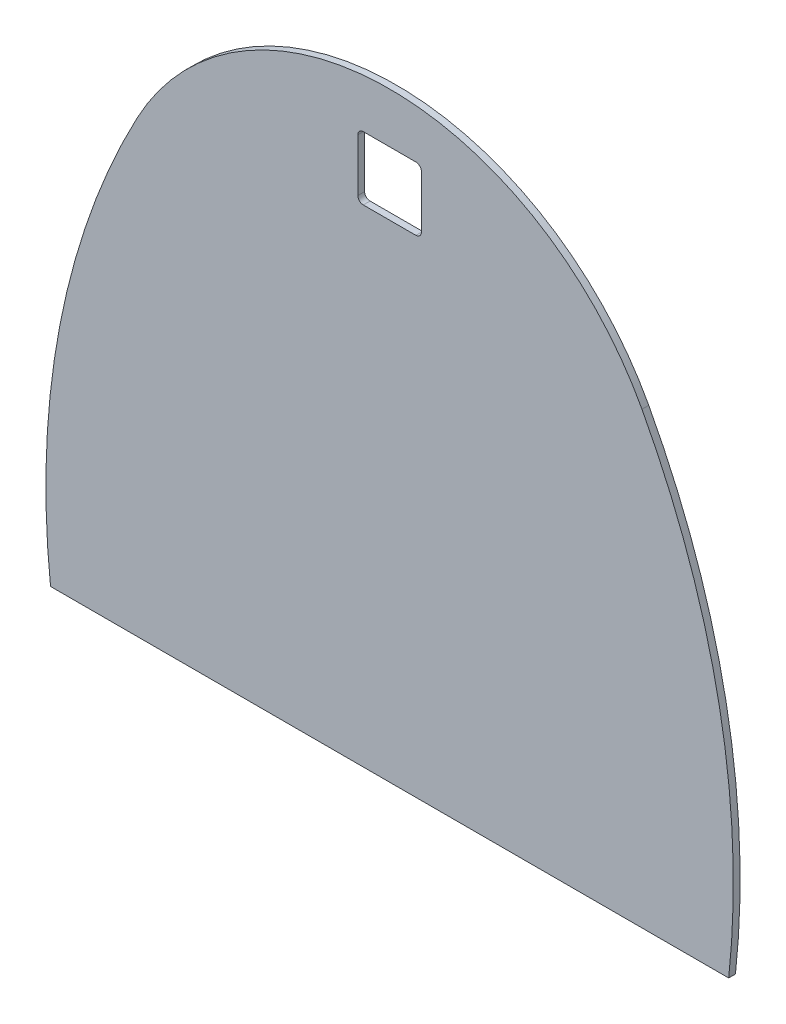
ISO-10303-21;
HEADER;
FILE_DESCRIPTION(('STEP AP214'),'2;1');
FILE_NAME('part.step','',(''),(''),'','','');
FILE_SCHEMA(('AUTOMOTIVE_DESIGN { 1 0 10303 214 1 1 1 1 }'));
ENDSEC;
DATA;
#1=APPLICATION_CONTEXT('core data for automotive mechanical design processes');
#2=APPLICATION_PROTOCOL_DEFINITION('international standard','automotive_design',2000,#1);
#3=PRODUCT_CONTEXT('',#1,'mechanical');
#4=PRODUCT('Part','Part','',(#3));
#5=PRODUCT_RELATED_PRODUCT_CATEGORY('part','',(#4));
#6=PRODUCT_DEFINITION_FORMATION('','',#4);
#7=PRODUCT_DEFINITION_CONTEXT('part definition',#1,'design');
#8=PRODUCT_DEFINITION('design','',#6,#7);
#9=PRODUCT_DEFINITION_SHAPE('','',#8);
#10=(LENGTH_UNIT() NAMED_UNIT(*) SI_UNIT(.MILLI.,.METRE.));
#11=(NAMED_UNIT(*) PLANE_ANGLE_UNIT() SI_UNIT($,.RADIAN.));
#12=(NAMED_UNIT(*) SI_UNIT($,.STERADIAN.) SOLID_ANGLE_UNIT());
#13=UNCERTAINTY_MEASURE_WITH_UNIT(LENGTH_MEASURE(1.E-05),#10,'distance_accuracy_value','');
#14=(GEOMETRIC_REPRESENTATION_CONTEXT(3) GLOBAL_UNCERTAINTY_ASSIGNED_CONTEXT((#13)) GLOBAL_UNIT_ASSIGNED_CONTEXT((#10,
#11,#12)) REPRESENTATION_CONTEXT('',''));
#15=CARTESIAN_POINT('',(0.,0.,0.));
#16=DIRECTION('',(0.,0.,1.));
#17=DIRECTION('',(1.,0.,0.));
#18=AXIS2_PLACEMENT_3D('',#15,#16,#17);
#19=CARTESIAN_POINT('',(0.,146.394206229881,3.175));
#20=DIRECTION('',(0.,0.,-1.));
#21=DIRECTION('',(-1.,0.,0.));
#22=AXIS2_PLACEMENT_3D('',#19,#20,#21);
#23=CYLINDRICAL_SURFACE('',#22,133.951547172083);
#24=CARTESIAN_POINT('',(0.,146.394206229881,0.));
#25=DIRECTION('',(0.,0.,1.));
#26=DIRECTION('',(1.,0.,0.));
#27=AXIS2_PLACEMENT_3D('',#24,#25,#26);
#28=CIRCLE('',#27,133.951547172083);
#29=CARTESIAN_POINT('',(-118.128585461186,209.55,0.));
#30=VERTEX_POINT('',#29);
#31=CARTESIAN_POINT('',(118.128585461186,209.55,0.));
#32=VERTEX_POINT('',#31);
#33=EDGE_CURVE('E203',#30,#32,#28,.F.);
#34=ORIENTED_EDGE('',*,*,#33,.F.);
#35=DIRECTION('',(0.,0.,-1.));
#36=VECTOR('',#35,1.);
#37=CARTESIAN_POINT('',(-118.128585461186,209.55,3.175));
#38=LINE('',#37,#36);
#39=CARTESIAN_POINT('',(-118.128585461186,209.55,3.175));
#40=VERTEX_POINT('',#39);
#41=EDGE_CURVE('E198',#40,#30,#38,.T.);
#42=ORIENTED_EDGE('',*,*,#41,.F.);
#43=CARTESIAN_POINT('',(0.,146.394206229881,3.175));
#44=DIRECTION('',(0.,0.,1.));
#45=DIRECTION('',(1.,0.,0.));
#46=AXIS2_PLACEMENT_3D('',#43,#44,#45);
#47=CIRCLE('',#46,133.951547172083);
#48=CARTESIAN_POINT('',(118.128585461186,209.55,3.175));
#49=VERTEX_POINT('',#48);
#50=EDGE_CURVE('E201',#40,#49,#47,.F.);
#51=ORIENTED_EDGE('',*,*,#50,.T.);
#52=DIRECTION('',(0.,0.,-1.));
#53=VECTOR('',#52,1.);
#54=CARTESIAN_POINT('',(118.128585461186,209.55,3.175));
#55=LINE('',#54,#53);
#56=EDGE_CURVE('E208',#49,#32,#55,.T.);
#57=ORIENTED_EDGE('',*,*,#56,.T.);
#58=EDGE_LOOP('',(#34,#42,#51,#57));
#59=FACE_BOUND('',#58,.T.);
#60=ADVANCED_FACE('F109',(#59),#23,.T.);
#61=CARTESIAN_POINT('',(0.,0.,3.175));
#62=DIRECTION('',(0.,0.,1.));
#63=DIRECTION('',(1.,0.,0.));
#64=AXIS2_PLACEMENT_3D('',#61,#62,#63);
#65=PLANE('',#64);
#66=DIRECTION('',(0.,1.,0.));
#67=VECTOR('',#66,1.);
#68=CARTESIAN_POINT('',(14.859,256.86141153755,3.175));
#69=LINE('',#68,#67);
#70=CARTESIAN_POINT('',(14.859,229.68341153755,3.175));
#71=VERTEX_POINT('',#70);
#72=CARTESIAN_POINT('',(14.859,254.32141153755,3.175));
#73=VERTEX_POINT('',#72);
#74=EDGE_CURVE('E335',#71,#73,#69,.T.);
#75=ORIENTED_EDGE('',*,*,#74,.F.);
#76=CARTESIAN_POINT('',(12.319,229.68341153755,3.175));
#77=DIRECTION('',(0.,0.,1.));
#78=DIRECTION('',(1.,0.,0.));
#79=AXIS2_PLACEMENT_3D('',#76,#77,#78);
#80=CIRCLE('',#79,2.54);
#81=CARTESIAN_POINT('',(12.319,227.14341153755,3.175));
#82=VERTEX_POINT('',#81);
#83=EDGE_CURVE('E261',#71,#82,#80,.F.);
#84=ORIENTED_EDGE('',*,*,#83,.T.);
#85=DIRECTION('',(1.,0.,0.));
#86=VECTOR('',#85,1.);
#87=CARTESIAN_POINT('',(-14.859,227.14341153755,3.175));
#88=LINE('',#87,#86);
#89=CARTESIAN_POINT('',(-12.319,227.14341153755,3.175));
#90=VERTEX_POINT('',#89);
#91=EDGE_CURVE('E344',#90,#82,#88,.T.);
#92=ORIENTED_EDGE('',*,*,#91,.F.);
#93=CARTESIAN_POINT('',(-12.319,229.68341153755,3.175));
#94=DIRECTION('',(0.,0.,1.));
#95=DIRECTION('',(1.,0.,0.));
#96=AXIS2_PLACEMENT_3D('',#93,#94,#95);
#97=CIRCLE('',#96,2.54);
#98=CARTESIAN_POINT('',(-14.859,229.68341153755,3.175));
#99=VERTEX_POINT('',#98);
#100=EDGE_CURVE('E117',#90,#99,#97,.F.);
#101=ORIENTED_EDGE('',*,*,#100,.T.);
#102=DIRECTION('',(0.,-1.,0.));
#103=VECTOR('',#102,1.);
#104=CARTESIAN_POINT('',(-14.859,256.86141153755,3.175));
#105=LINE('',#104,#103);
#106=CARTESIAN_POINT('',(-14.859,254.32141153755,3.175));
#107=VERTEX_POINT('',#106);
#108=EDGE_CURVE('E343',#107,#99,#105,.T.);
#109=ORIENTED_EDGE('',*,*,#108,.F.);
#110=CARTESIAN_POINT('',(-12.319,254.32141153755,3.175));
#111=DIRECTION('',(0.,0.,1.));
#112=DIRECTION('',(1.,0.,0.));
#113=AXIS2_PLACEMENT_3D('',#110,#111,#112);
#114=CIRCLE('',#113,2.54);
#115=CARTESIAN_POINT('',(-12.319,256.86141153755,3.175));
#116=VERTEX_POINT('',#115);
#117=EDGE_CURVE('E131',#107,#116,#114,.F.);
#118=ORIENTED_EDGE('',*,*,#117,.T.);
#119=DIRECTION('',(-1.,0.,0.));
#120=VECTOR('',#119,1.);
#121=CARTESIAN_POINT('',(-14.859,256.86141153755,3.175));
#122=LINE('',#121,#120);
#123=CARTESIAN_POINT('',(12.319,256.86141153755,3.175));
#124=VERTEX_POINT('',#123);
#125=EDGE_CURVE('E337',#124,#116,#122,.T.);
#126=ORIENTED_EDGE('',*,*,#125,.F.);
#127=CARTESIAN_POINT('',(12.319,254.32141153755,3.175));
#128=DIRECTION('',(0.,0.,1.));
#129=DIRECTION('',(1.,0.,0.));
#130=AXIS2_PLACEMENT_3D('',#127,#128,#129);
#131=CIRCLE('',#130,2.54);
#132=EDGE_CURVE('E265',#124,#73,#131,.F.);
#133=ORIENTED_EDGE('',*,*,#132,.T.);
#134=EDGE_LOOP('',(#75,#84,#92,#101,#109,#118,#126,#133));
#135=FACE_BOUND('',#134,.T.);
#136=DIRECTION('',(1.,0.,0.));
#137=VECTOR('',#136,1.);
#138=CARTESIAN_POINT('',(0.,-0.694588462450615,3.175));
#139=LINE('',#138,#137);
#140=CARTESIAN_POINT('',(-158.711897247883,-0.69458846245047,3.175));
#141=VERTEX_POINT('',#140);
#142=CARTESIAN_POINT('',(158.711897247883,-0.694588462450761,3.175));
#143=VERTEX_POINT('',#142);
#144=EDGE_CURVE('E230',#141,#143,#139,.T.);
#145=ORIENTED_EDGE('',*,*,#144,.T.);
#146=CARTESIAN_POINT('',(-201.066245881437,38.8969538972305,3.175));
#147=DIRECTION('',(0.,0.,-1.));
#148=DIRECTION('',(-1.,0.,0.));
#149=AXIS2_PLACEMENT_3D('',#146,#147,#148);
#150=CIRCLE('',#149,361.95);
#151=EDGE_CURVE('E218',#49,#143,#150,.T.);
#152=ORIENTED_EDGE('',*,*,#151,.F.);
#153=ORIENTED_EDGE('',*,*,#50,.F.);
#154=CARTESIAN_POINT('',(201.066245881437,38.8969538972305,3.175));
#155=DIRECTION('',(0.,0.,1.));
#156=DIRECTION('',(1.,0.,0.));
#157=AXIS2_PLACEMENT_3D('',#154,#155,#156);
#158=CIRCLE('',#157,361.95);
#159=EDGE_CURVE('E211',#40,#141,#158,.T.);
#160=ORIENTED_EDGE('',*,*,#159,.T.);
#161=EDGE_LOOP('',(#145,#152,#153,#160));
#162=FACE_BOUND('',#161,.T.);
#163=ADVANCED_FACE('F221',(#135,#162),#65,.T.);
#164=CARTESIAN_POINT('',(0.,0.,0.));
#165=DIRECTION('',(0.,0.,1.));
#166=DIRECTION('',(1.,0.,0.));
#167=AXIS2_PLACEMENT_3D('',#164,#165,#166);
#168=PLANE('',#167);
#169=DIRECTION('',(-1.,0.,0.));
#170=VECTOR('',#169,1.);
#171=CARTESIAN_POINT('',(-14.859,227.14341153755,0.));
#172=LINE('',#171,#170);
#173=CARTESIAN_POINT('',(12.319,227.14341153755,0.));
#174=VERTEX_POINT('',#173);
#175=CARTESIAN_POINT('',(-12.319,227.14341153755,0.));
#176=VERTEX_POINT('',#175);
#177=EDGE_CURVE('E285',#174,#176,#172,.T.);
#178=ORIENTED_EDGE('',*,*,#177,.F.);
#179=CARTESIAN_POINT('',(12.319,229.68341153755,0.));
#180=DIRECTION('',(0.,0.,1.));
#181=DIRECTION('',(1.,0.,0.));
#182=AXIS2_PLACEMENT_3D('',#179,#180,#181);
#183=CIRCLE('',#182,2.54);
#184=CARTESIAN_POINT('',(14.859,229.68341153755,0.));
#185=VERTEX_POINT('',#184);
#186=EDGE_CURVE('E263',#174,#185,#183,.T.);
#187=ORIENTED_EDGE('',*,*,#186,.T.);
#188=DIRECTION('',(0.,-1.,0.));
#189=VECTOR('',#188,1.);
#190=CARTESIAN_POINT('',(14.859,256.86141153755,0.));
#191=LINE('',#190,#189);
#192=CARTESIAN_POINT('',(14.859,254.32141153755,0.));
#193=VERTEX_POINT('',#192);
#194=EDGE_CURVE('E328',#193,#185,#191,.T.);
#195=ORIENTED_EDGE('',*,*,#194,.F.);
#196=CARTESIAN_POINT('',(12.319,254.32141153755,0.));
#197=DIRECTION('',(0.,0.,1.));
#198=DIRECTION('',(1.,0.,0.));
#199=AXIS2_PLACEMENT_3D('',#196,#197,#198);
#200=CIRCLE('',#199,2.54);
#201=CARTESIAN_POINT('',(12.319,256.86141153755,0.));
#202=VERTEX_POINT('',#201);
#203=EDGE_CURVE('E267',#193,#202,#200,.T.);
#204=ORIENTED_EDGE('',*,*,#203,.T.);
#205=DIRECTION('',(1.,0.,0.));
#206=VECTOR('',#205,1.);
#207=CARTESIAN_POINT('',(-14.859,256.86141153755,0.));
#208=LINE('',#207,#206);
#209=CARTESIAN_POINT('',(-12.319,256.86141153755,0.));
#210=VERTEX_POINT('',#209);
#211=EDGE_CURVE('E227',#210,#202,#208,.T.);
#212=ORIENTED_EDGE('',*,*,#211,.F.);
#213=CARTESIAN_POINT('',(-12.319,254.32141153755,0.));
#214=DIRECTION('',(0.,0.,1.));
#215=DIRECTION('',(1.,0.,0.));
#216=AXIS2_PLACEMENT_3D('',#213,#214,#215);
#217=CIRCLE('',#216,2.54);
#218=CARTESIAN_POINT('',(-14.859,254.32141153755,0.));
#219=VERTEX_POINT('',#218);
#220=EDGE_CURVE('E270',#210,#219,#217,.T.);
#221=ORIENTED_EDGE('',*,*,#220,.T.);
#222=DIRECTION('',(0.,1.,0.));
#223=VECTOR('',#222,1.);
#224=CARTESIAN_POINT('',(-14.859,256.86141153755,0.));
#225=LINE('',#224,#223);
#226=CARTESIAN_POINT('',(-14.859,229.68341153755,0.));
#227=VERTEX_POINT('',#226);
#228=EDGE_CURVE('E279',#227,#219,#225,.T.);
#229=ORIENTED_EDGE('',*,*,#228,.F.);
#230=CARTESIAN_POINT('',(-12.319,229.68341153755,0.));
#231=DIRECTION('',(0.,0.,1.));
#232=DIRECTION('',(1.,0.,0.));
#233=AXIS2_PLACEMENT_3D('',#230,#231,#232);
#234=CIRCLE('',#233,2.54);
#235=EDGE_CURVE('E12',#227,#176,#234,.T.);
#236=ORIENTED_EDGE('',*,*,#235,.T.);
#237=EDGE_LOOP('',(#178,#187,#195,#204,#212,#221,#229,#236));
#238=FACE_BOUND('',#237,.T.);
#239=CARTESIAN_POINT('',(-201.066245881437,38.8969538972305,0.));
#240=DIRECTION('',(0.,0.,-1.));
#241=DIRECTION('',(-1.,0.,0.));
#242=AXIS2_PLACEMENT_3D('',#239,#240,#241);
#243=CIRCLE('',#242,361.95);
#244=CARTESIAN_POINT('',(158.711897247883,-0.694588462450761,0.));
#245=VERTEX_POINT('',#244);
#246=EDGE_CURVE('E239',#32,#245,#243,.T.);
#247=ORIENTED_EDGE('',*,*,#246,.T.);
#248=DIRECTION('',(1.,0.,0.));
#249=VECTOR('',#248,1.);
#250=CARTESIAN_POINT('',(0.,-0.694588462450615,0.));
#251=LINE('',#250,#249);
#252=CARTESIAN_POINT('',(-158.711897247883,-0.69458846245047,0.));
#253=VERTEX_POINT('',#252);
#254=EDGE_CURVE('E217',#253,#245,#251,.T.);
#255=ORIENTED_EDGE('',*,*,#254,.F.);
#256=CARTESIAN_POINT('',(201.066245881437,38.8969538972305,0.));
#257=DIRECTION('',(0.,0.,1.));
#258=DIRECTION('',(1.,0.,0.));
#259=AXIS2_PLACEMENT_3D('',#256,#257,#258);
#260=CIRCLE('',#259,361.95);
#261=EDGE_CURVE('E237',#30,#253,#260,.T.);
#262=ORIENTED_EDGE('',*,*,#261,.F.);
#263=ORIENTED_EDGE('',*,*,#33,.T.);
#264=EDGE_LOOP('',(#247,#255,#262,#263));
#265=FACE_BOUND('',#264,.T.);
#266=ADVANCED_FACE('F277',(#238,#265),#168,.F.);
#267=CARTESIAN_POINT('',(0.,-0.694588462450615,3.175));
#268=DIRECTION('',(0.,1.,0.));
#269=DIRECTION('',(-1.,0.,0.));
#270=AXIS2_PLACEMENT_3D('',#267,#268,#269);
#271=PLANE('',#270);
#272=ORIENTED_EDGE('',*,*,#254,.T.);
#273=DIRECTION('',(0.,0.,-1.));
#274=VECTOR('',#273,1.);
#275=CARTESIAN_POINT('',(158.711897247883,-0.694588462450761,3.175));
#276=LINE('',#275,#274);
#277=EDGE_CURVE('E232',#143,#245,#276,.T.);
#278=ORIENTED_EDGE('',*,*,#277,.F.);
#279=ORIENTED_EDGE('',*,*,#144,.F.);
#280=DIRECTION('',(0.,0.,-1.));
#281=VECTOR('',#280,1.);
#282=CARTESIAN_POINT('',(-158.711897247883,-0.69458846245047,3.175));
#283=LINE('',#282,#281);
#284=EDGE_CURVE('E213',#141,#253,#283,.T.);
#285=ORIENTED_EDGE('',*,*,#284,.T.);
#286=EDGE_LOOP('',(#272,#278,#279,#285));
#287=FACE_BOUND('',#286,.T.);
#288=ADVANCED_FACE('F298',(#287),#271,.F.);
#289=CARTESIAN_POINT('',(201.066245881437,38.8969538972305,3.175));
#290=DIRECTION('',(0.,0.,-1.));
#291=DIRECTION('',(-1.,0.,0.));
#292=AXIS2_PLACEMENT_3D('',#289,#290,#291);
#293=CYLINDRICAL_SURFACE('',#292,361.95);
#294=ORIENTED_EDGE('',*,*,#261,.T.);
#295=ORIENTED_EDGE('',*,*,#284,.F.);
#296=ORIENTED_EDGE('',*,*,#159,.F.);
#297=ORIENTED_EDGE('',*,*,#41,.T.);
#298=EDGE_LOOP('',(#294,#295,#296,#297));
#299=FACE_BOUND('',#298,.T.);
#300=ADVANCED_FACE('F212',(#299),#293,.T.);
#301=CARTESIAN_POINT('',(-201.066245881437,38.8969538972305,3.175));
#302=DIRECTION('',(0.,0.,-1.));
#303=DIRECTION('',(-1.,0.,0.));
#304=AXIS2_PLACEMENT_3D('',#301,#302,#303);
#305=CYLINDRICAL_SURFACE('',#304,361.95);
#306=ORIENTED_EDGE('',*,*,#246,.F.);
#307=ORIENTED_EDGE('',*,*,#56,.F.);
#308=ORIENTED_EDGE('',*,*,#151,.T.);
#309=ORIENTED_EDGE('',*,*,#277,.T.);
#310=EDGE_LOOP('',(#306,#307,#308,#309));
#311=FACE_BOUND('',#310,.T.);
#312=ADVANCED_FACE('F306',(#311),#305,.T.);
#313=CARTESIAN_POINT('',(14.859,256.86141153755,-0.00100000000000013));
#314=DIRECTION('',(1.,0.,0.));
#315=DIRECTION('',(0.,1.,0.));
#316=AXIS2_PLACEMENT_3D('',#313,#314,#315);
#317=PLANE('',#316);
#318=ORIENTED_EDGE('',*,*,#194,.T.);
#319=DIRECTION('',(0.,0.,1.));
#320=VECTOR('',#319,1.);
#321=CARTESIAN_POINT('',(14.859,229.68341153755,3.175));
#322=LINE('',#321,#320);
#323=EDGE_CURVE('E244',#185,#71,#322,.T.);
#324=ORIENTED_EDGE('',*,*,#323,.T.);
#325=ORIENTED_EDGE('',*,*,#74,.T.);
#326=DIRECTION('',(0.,0.,1.));
#327=VECTOR('',#326,1.);
#328=CARTESIAN_POINT('',(14.859,254.32141153755,0.));
#329=LINE('',#328,#327);
#330=EDGE_CURVE('E207',#73,#193,#329,.F.);
#331=ORIENTED_EDGE('',*,*,#330,.T.);
#332=EDGE_LOOP('',(#318,#324,#325,#331));
#333=FACE_BOUND('',#332,.T.);
#334=ADVANCED_FACE('F309',(#333),#317,.F.);
#335=CARTESIAN_POINT('',(-14.859,227.14341153755,-0.00100000000000013));
#336=DIRECTION('',(0.,-1.,0.));
#337=DIRECTION('',(0.,0.,-1.));
#338=AXIS2_PLACEMENT_3D('',#335,#336,#337);
#339=PLANE('',#338);
#340=ORIENTED_EDGE('',*,*,#91,.T.);
#341=DIRECTION('',(0.,0.,1.));
#342=VECTOR('',#341,1.);
#343=CARTESIAN_POINT('',(12.319,227.14341153755,0.));
#344=LINE('',#343,#342);
#345=EDGE_CURVE('E250',#82,#174,#344,.F.);
#346=ORIENTED_EDGE('',*,*,#345,.T.);
#347=ORIENTED_EDGE('',*,*,#177,.T.);
#348=DIRECTION('',(0.,0.,1.));
#349=VECTOR('',#348,1.);
#350=CARTESIAN_POINT('',(-12.319,227.14341153755,3.175));
#351=LINE('',#350,#349);
#352=EDGE_CURVE('E247',#176,#90,#351,.T.);
#353=ORIENTED_EDGE('',*,*,#352,.T.);
#354=EDGE_LOOP('',(#340,#346,#347,#353));
#355=FACE_BOUND('',#354,.T.);
#356=ADVANCED_FACE('F350',(#355),#339,.F.);
#357=CARTESIAN_POINT('',(-14.859,256.86141153755,-0.00100000000000013));
#358=DIRECTION('',(-1.,0.,0.));
#359=DIRECTION('',(0.,-1.,0.));
#360=AXIS2_PLACEMENT_3D('',#357,#358,#359);
#361=PLANE('',#360);
#362=ORIENTED_EDGE('',*,*,#228,.T.);
#363=DIRECTION('',(0.,0.,1.));
#364=VECTOR('',#363,1.);
#365=CARTESIAN_POINT('',(-14.859,254.32141153755,3.175));
#366=LINE('',#365,#364);
#367=EDGE_CURVE('E259',#219,#107,#366,.T.);
#368=ORIENTED_EDGE('',*,*,#367,.T.);
#369=ORIENTED_EDGE('',*,*,#108,.T.);
#370=DIRECTION('',(0.,0.,1.));
#371=VECTOR('',#370,1.);
#372=CARTESIAN_POINT('',(-14.859,229.68341153755,0.));
#373=LINE('',#372,#371);
#374=EDGE_CURVE('E257',#99,#227,#373,.F.);
#375=ORIENTED_EDGE('',*,*,#374,.T.);
#376=EDGE_LOOP('',(#362,#368,#369,#375));
#377=FACE_BOUND('',#376,.T.);
#378=ADVANCED_FACE('F283',(#377),#361,.F.);
#379=CARTESIAN_POINT('',(-14.859,256.86141153755,-0.00100000000000013));
#380=DIRECTION('',(0.,1.,0.));
#381=DIRECTION('',(0.,0.,1.));
#382=AXIS2_PLACEMENT_3D('',#379,#380,#381);
#383=PLANE('',#382);
#384=ORIENTED_EDGE('',*,*,#211,.T.);
#385=DIRECTION('',(0.,0.,1.));
#386=VECTOR('',#385,1.);
#387=CARTESIAN_POINT('',(12.319,256.86141153755,3.175));
#388=LINE('',#387,#386);
#389=EDGE_CURVE('E254',#202,#124,#388,.T.);
#390=ORIENTED_EDGE('',*,*,#389,.T.);
#391=ORIENTED_EDGE('',*,*,#125,.T.);
#392=DIRECTION('',(0.,0.,1.));
#393=VECTOR('',#392,1.);
#394=CARTESIAN_POINT('',(-12.319,256.86141153755,0.));
#395=LINE('',#394,#393);
#396=EDGE_CURVE('E252',#116,#210,#395,.F.);
#397=ORIENTED_EDGE('',*,*,#396,.T.);
#398=EDGE_LOOP('',(#384,#390,#391,#397));
#399=FACE_BOUND('',#398,.T.);
#400=ADVANCED_FACE('F316',(#399),#383,.F.);
#401=CARTESIAN_POINT('',(12.319,229.68341153755,-0.00100000000000013));
#402=DIRECTION('',(0.,0.,-1.));
#403=DIRECTION('',(-1.,0.,0.));
#404=AXIS2_PLACEMENT_3D('',#401,#402,#403);
#405=CYLINDRICAL_SURFACE('',#404,2.54);
#406=ORIENTED_EDGE('',*,*,#186,.F.);
#407=ORIENTED_EDGE('',*,*,#345,.F.);
#408=ORIENTED_EDGE('',*,*,#83,.F.);
#409=ORIENTED_EDGE('',*,*,#323,.F.);
#410=EDGE_LOOP('',(#406,#407,#408,#409));
#411=FACE_BOUND('',#410,.T.);
#412=ADVANCED_FACE('F295',(#411),#405,.F.);
#413=CARTESIAN_POINT('',(12.319,254.32141153755,-0.00100000000000013));
#414=DIRECTION('',(0.,0.,-1.));
#415=DIRECTION('',(-1.,0.,0.));
#416=AXIS2_PLACEMENT_3D('',#413,#414,#415);
#417=CYLINDRICAL_SURFACE('',#416,2.54);
#418=ORIENTED_EDGE('',*,*,#203,.F.);
#419=ORIENTED_EDGE('',*,*,#330,.F.);
#420=ORIENTED_EDGE('',*,*,#132,.F.);
#421=ORIENTED_EDGE('',*,*,#389,.F.);
#422=EDGE_LOOP('',(#418,#419,#420,#421));
#423=FACE_BOUND('',#422,.T.);
#424=ADVANCED_FACE('F289',(#423),#417,.F.);
#425=CARTESIAN_POINT('',(-12.319,254.32141153755,-0.00100000000000013));
#426=DIRECTION('',(0.,0.,-1.));
#427=DIRECTION('',(-1.,0.,0.));
#428=AXIS2_PLACEMENT_3D('',#425,#426,#427);
#429=CYLINDRICAL_SURFACE('',#428,2.54);
#430=ORIENTED_EDGE('',*,*,#220,.F.);
#431=ORIENTED_EDGE('',*,*,#396,.F.);
#432=ORIENTED_EDGE('',*,*,#117,.F.);
#433=ORIENTED_EDGE('',*,*,#367,.F.);
#434=EDGE_LOOP('',(#430,#431,#432,#433));
#435=FACE_BOUND('',#434,.T.);
#436=ADVANCED_FACE('F287',(#435),#429,.F.);
#437=CARTESIAN_POINT('',(-12.319,229.68341153755,-0.00100000000000013));
#438=DIRECTION('',(0.,0.,-1.));
#439=DIRECTION('',(-1.,0.,0.));
#440=AXIS2_PLACEMENT_3D('',#437,#438,#439);
#441=CYLINDRICAL_SURFACE('',#440,2.54);
#442=ORIENTED_EDGE('',*,*,#235,.F.);
#443=ORIENTED_EDGE('',*,*,#374,.F.);
#444=ORIENTED_EDGE('',*,*,#100,.F.);
#445=ORIENTED_EDGE('',*,*,#352,.F.);
#446=EDGE_LOOP('',(#442,#443,#444,#445));
#447=FACE_BOUND('',#446,.T.);
#448=ADVANCED_FACE('F111',(#447),#441,.F.);
#449=CLOSED_SHELL('',(#60,#163,#266,#288,#300,#312,#334,#356,#378,#400,#412,#424,#436,#448));
#450=MANIFOLD_SOLID_BREP('B2',#449);
#451=ADVANCED_BREP_SHAPE_REPRESENTATION('',(#18,#450),#14);
#452=SHAPE_DEFINITION_REPRESENTATION(#9,#451);
ENDSEC;
END-ISO-10303-21;
